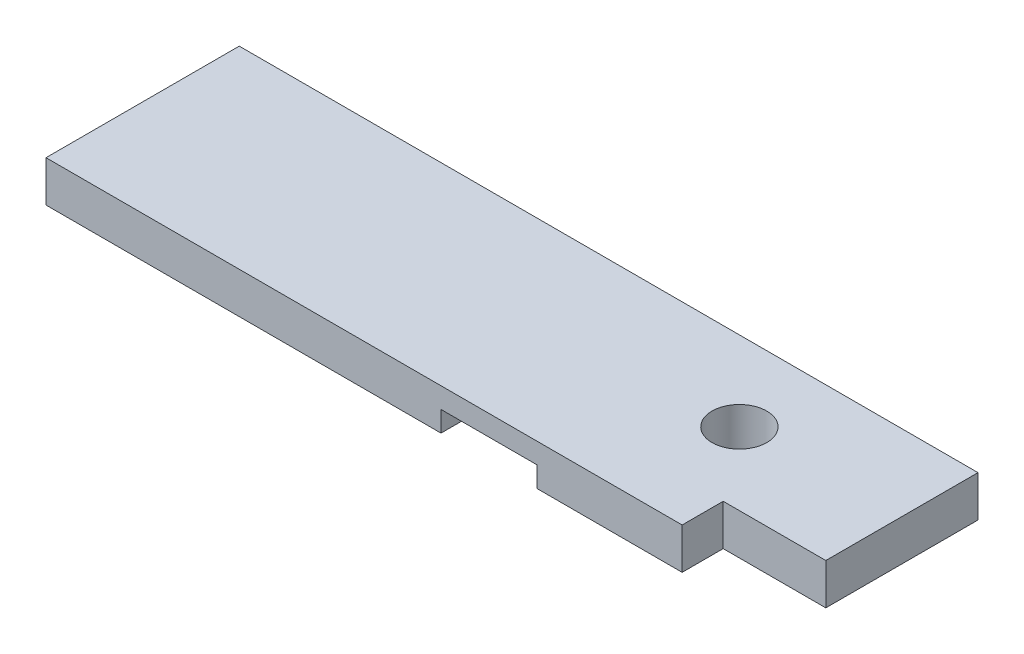
ISO-10303-21;
HEADER;
FILE_DESCRIPTION(('STEP AP214'),'2;1');
FILE_NAME('part.step','',(''),(''),'','','');
FILE_SCHEMA(('AUTOMOTIVE_DESIGN { 1 0 10303 214 1 1 1 1 }'));
ENDSEC;
DATA;
#1=APPLICATION_CONTEXT('core data for automotive mechanical design processes');
#2=APPLICATION_PROTOCOL_DEFINITION('international standard','automotive_design',2000,#1);
#3=PRODUCT_CONTEXT('',#1,'mechanical');
#4=PRODUCT('Part','Part','',(#3));
#5=PRODUCT_RELATED_PRODUCT_CATEGORY('part','',(#4));
#6=PRODUCT_DEFINITION_FORMATION('','',#4);
#7=PRODUCT_DEFINITION_CONTEXT('part definition',#1,'design');
#8=PRODUCT_DEFINITION('design','',#6,#7);
#9=PRODUCT_DEFINITION_SHAPE('','',#8);
#10=(LENGTH_UNIT() NAMED_UNIT(*) SI_UNIT(.MILLI.,.METRE.));
#11=(NAMED_UNIT(*) PLANE_ANGLE_UNIT() SI_UNIT($,.RADIAN.));
#12=(NAMED_UNIT(*) SI_UNIT($,.STERADIAN.) SOLID_ANGLE_UNIT());
#13=UNCERTAINTY_MEASURE_WITH_UNIT(LENGTH_MEASURE(1.E-05),#10,'distance_accuracy_value','');
#14=(GEOMETRIC_REPRESENTATION_CONTEXT(3) GLOBAL_UNCERTAINTY_ASSIGNED_CONTEXT((#13)) GLOBAL_UNIT_ASSIGNED_CONTEXT((#10,
#11,#12)) REPRESENTATION_CONTEXT('',''));
#15=CARTESIAN_POINT('',(0.,0.,0.));
#16=DIRECTION('',(0.,0.,1.));
#17=DIRECTION('',(1.,0.,0.));
#18=AXIS2_PLACEMENT_3D('',#15,#16,#17);
#19=CARTESIAN_POINT('',(0.,0.,0.));
#20=DIRECTION('',(0.,-1.,0.));
#21=DIRECTION('',(0.,0.,-1.));
#22=AXIS2_PLACEMENT_3D('',#19,#20,#21);
#23=PLANE('',#22);
#24=DIRECTION('',(0.,0.,-1.));
#25=VECTOR('',#24,1.);
#26=CARTESIAN_POINT('',(366.70104079,0.,179.400200000003));
#27=LINE('',#26,#25);
#28=CARTESIAN_POINT('',(366.70104079,0.,179.400200000003));
#29=VERTEX_POINT('',#28);
#30=CARTESIAN_POINT('',(366.70104079,0.,0.));
#31=VERTEX_POINT('',#30);
#32=EDGE_CURVE('E234',#29,#31,#27,.T.);
#33=ORIENTED_EDGE('',*,*,#32,.F.);
#34=DIRECTION('',(1.,0.,0.));
#35=VECTOR('',#34,1.);
#36=CARTESIAN_POINT('',(590.5627,0.,179.400200000003));
#37=LINE('',#36,#35);
#38=CARTESIAN_POINT('',(0.,0.,179.400200000003));
#39=VERTEX_POINT('',#38);
#40=EDGE_CURVE('E154',#39,#29,#37,.T.);
#41=ORIENTED_EDGE('',*,*,#40,.F.);
#42=DIRECTION('',(0.,0.,1.));
#43=VECTOR('',#42,1.);
#44=CARTESIAN_POINT('',(0.,0.,0.));
#45=LINE('',#44,#43);
#46=CARTESIAN_POINT('',(0.,0.,0.));
#47=VERTEX_POINT('',#46);
#48=EDGE_CURVE('E148',#47,#39,#45,.T.);
#49=ORIENTED_EDGE('',*,*,#48,.F.);
#50=DIRECTION('',(-1.,0.,0.));
#51=VECTOR('',#50,1.);
#52=CARTESIAN_POINT('',(685.812700000001,0.,0.));
#53=LINE('',#52,#51);
#54=EDGE_CURVE('E95',#31,#47,#53,.T.);
#55=ORIENTED_EDGE('',*,*,#54,.F.);
#56=EDGE_LOOP('',(#33,#41,#49,#55));
#57=FACE_BOUND('',#56,.T.);
#58=ADVANCED_FACE('F43',(#57),#23,.T.);
#59=CARTESIAN_POINT('',(0.,38.1,0.));
#60=DIRECTION('',(0.,-1.,0.));
#61=DIRECTION('',(0.,0.,-1.));
#62=AXIS2_PLACEMENT_3D('',#59,#60,#61);
#63=PLANE('',#62);
#64=DIRECTION('',(0.,0.,1.));
#65=VECTOR('',#64,1.);
#66=CARTESIAN_POINT('',(0.,38.1,0.));
#67=LINE('',#66,#65);
#68=CARTESIAN_POINT('',(0.,38.1,0.));
#69=VERTEX_POINT('',#68);
#70=CARTESIAN_POINT('',(0.,38.1,179.400200000003));
#71=VERTEX_POINT('',#70);
#72=EDGE_CURVE('E170',#69,#71,#67,.T.);
#73=ORIENTED_EDGE('',*,*,#72,.T.);
#74=DIRECTION('',(1.,0.,0.));
#75=VECTOR('',#74,1.);
#76=CARTESIAN_POINT('',(590.5627,38.1,179.400200000003));
#77=LINE('',#76,#75);
#78=CARTESIAN_POINT('',(590.5627,38.1,179.400200000003));
#79=VERTEX_POINT('',#78);
#80=EDGE_CURVE('E103',#71,#79,#77,.T.);
#81=ORIENTED_EDGE('',*,*,#80,.T.);
#82=DIRECTION('',(0.,0.,-1.));
#83=VECTOR('',#82,1.);
#84=CARTESIAN_POINT('',(590.5627,38.1,141.2875));
#85=LINE('',#84,#83);
#86=CARTESIAN_POINT('',(590.5627,38.1,141.2875));
#87=VERTEX_POINT('',#86);
#88=EDGE_CURVE('E121',#79,#87,#85,.T.);
#89=ORIENTED_EDGE('',*,*,#88,.T.);
#90=DIRECTION('',(1.,0.,0.));
#91=VECTOR('',#90,1.);
#92=CARTESIAN_POINT('',(685.812700000001,38.1,141.2875));
#93=LINE('',#92,#91);
#94=CARTESIAN_POINT('',(685.812700000001,38.1,141.2875));
#95=VERTEX_POINT('',#94);
#96=EDGE_CURVE('E113',#87,#95,#93,.T.);
#97=ORIENTED_EDGE('',*,*,#96,.T.);
#98=DIRECTION('',(0.,0.,-1.));
#99=VECTOR('',#98,1.);
#100=CARTESIAN_POINT('',(685.812700000001,38.1,0.));
#101=LINE('',#100,#99);
#102=CARTESIAN_POINT('',(685.812700000001,38.1,0.));
#103=VERTEX_POINT('',#102);
#104=EDGE_CURVE('E118',#95,#103,#101,.T.);
#105=ORIENTED_EDGE('',*,*,#104,.T.);
#106=DIRECTION('',(-1.,0.,0.));
#107=VECTOR('',#106,1.);
#108=CARTESIAN_POINT('',(685.812700000001,38.1,0.));
#109=LINE('',#108,#107);
#110=EDGE_CURVE('E68',#103,#69,#109,.T.);
#111=ORIENTED_EDGE('',*,*,#110,.T.);
#112=EDGE_LOOP('',(#73,#81,#89,#97,#105,#111));
#113=FACE_BOUND('',#112,.T.);
#114=CARTESIAN_POINT('',(538.226,38.1,73.9181909999946));
#115=DIRECTION('',(0.,1.,0.));
#116=DIRECTION('',(0.,0.,1.));
#117=AXIS2_PLACEMENT_3D('',#114,#115,#116);
#118=CIRCLE('',#117,25.4);
#119=CARTESIAN_POINT('',(538.226,38.1,99.3181909999946));
#120=VERTEX_POINT('',#119);
#121=EDGE_CURVE('E153',#120,#120,#118,.T.);
#122=ORIENTED_EDGE('',*,*,#121,.F.);
#123=EDGE_LOOP('',(#122));
#124=FACE_BOUND('',#123,.T.);
#125=ADVANCED_FACE('F115',(#113,#124),#63,.F.);
#126=DIRECTION('',(0.,0.,1.));
#127=VECTOR('',#126,1.);
#128=CARTESIAN_POINT('',(455.60104079,0.,179.400200000003));
#129=LINE('',#128,#127);
#130=CARTESIAN_POINT('',(455.60104079,0.,0.));
#131=VERTEX_POINT('',#130);
#132=CARTESIAN_POINT('',(455.60104079,0.,179.400200000003));
#133=VERTEX_POINT('',#132);
#134=EDGE_CURVE('E230',#131,#133,#129,.T.);
#135=ORIENTED_EDGE('',*,*,#134,.F.);
#136=CARTESIAN_POINT('',(685.812700000001,0.,0.));
#137=VERTEX_POINT('',#136);
#138=EDGE_CURVE('E166',#137,#131,#53,.T.);
#139=ORIENTED_EDGE('',*,*,#138,.F.);
#140=DIRECTION('',(0.,0.,-1.));
#141=VECTOR('',#140,1.);
#142=CARTESIAN_POINT('',(685.812700000001,0.,0.));
#143=LINE('',#142,#141);
#144=CARTESIAN_POINT('',(685.812700000001,0.,141.2875));
#145=VERTEX_POINT('',#144);
#146=EDGE_CURVE('E163',#145,#137,#143,.T.);
#147=ORIENTED_EDGE('',*,*,#146,.F.);
#148=DIRECTION('',(1.,0.,0.));
#149=VECTOR('',#148,1.);
#150=CARTESIAN_POINT('',(685.812700000001,0.,141.2875));
#151=LINE('',#150,#149);
#152=CARTESIAN_POINT('',(590.5627,0.,141.2875));
#153=VERTEX_POINT('',#152);
#154=EDGE_CURVE('E131',#153,#145,#151,.T.);
#155=ORIENTED_EDGE('',*,*,#154,.F.);
#156=DIRECTION('',(0.,0.,-1.));
#157=VECTOR('',#156,1.);
#158=CARTESIAN_POINT('',(590.5627,0.,141.2875));
#159=LINE('',#158,#157);
#160=CARTESIAN_POINT('',(590.5627,0.,179.400200000003));
#161=VERTEX_POINT('',#160);
#162=EDGE_CURVE('E158',#161,#153,#159,.T.);
#163=ORIENTED_EDGE('',*,*,#162,.F.);
#164=EDGE_CURVE('E152',#133,#161,#37,.T.);
#165=ORIENTED_EDGE('',*,*,#164,.F.);
#166=EDGE_LOOP('',(#135,#139,#147,#155,#163,#165));
#167=FACE_BOUND('',#166,.T.);
#168=CARTESIAN_POINT('',(538.226,0.,73.9181909999946));
#169=DIRECTION('',(0.,1.,0.));
#170=DIRECTION('',(0.,0.,1.));
#171=AXIS2_PLACEMENT_3D('',#168,#169,#170);
#172=CIRCLE('',#171,25.4);
#173=CARTESIAN_POINT('',(538.226,0.,99.3181909999946));
#174=VERTEX_POINT('',#173);
#175=EDGE_CURVE('E203',#174,#174,#172,.T.);
#176=ORIENTED_EDGE('',*,*,#175,.T.);
#177=EDGE_LOOP('',(#176));
#178=FACE_BOUND('',#177,.T.);
#179=ADVANCED_FACE('F185',(#167,#178),#23,.T.);
#180=CARTESIAN_POINT('',(0.,38.1,0.));
#181=DIRECTION('',(1.,0.,0.));
#182=DIRECTION('',(0.,0.,-1.));
#183=AXIS2_PLACEMENT_3D('',#180,#181,#182);
#184=PLANE('',#183);
#185=ORIENTED_EDGE('',*,*,#48,.T.);
#186=DIRECTION('',(0.,-1.,0.));
#187=VECTOR('',#186,1.);
#188=CARTESIAN_POINT('',(0.,38.1,179.400200000003));
#189=LINE('',#188,#187);
#190=EDGE_CURVE('E11',#71,#39,#189,.T.);
#191=ORIENTED_EDGE('',*,*,#190,.F.);
#192=ORIENTED_EDGE('',*,*,#72,.F.);
#193=DIRECTION('',(0.,-1.,0.));
#194=VECTOR('',#193,1.);
#195=CARTESIAN_POINT('',(0.,38.1,0.));
#196=LINE('',#195,#194);
#197=EDGE_CURVE('E144',#69,#47,#196,.T.);
#198=ORIENTED_EDGE('',*,*,#197,.T.);
#199=EDGE_LOOP('',(#185,#191,#192,#198));
#200=FACE_BOUND('',#199,.T.);
#201=ADVANCED_FACE('F45',(#200),#184,.F.);
#202=CARTESIAN_POINT('',(590.5627,38.1,179.400200000003));
#203=DIRECTION('',(0.,0.,-1.));
#204=DIRECTION('',(-1.,0.,0.));
#205=AXIS2_PLACEMENT_3D('',#202,#203,#204);
#206=PLANE('',#205);
#207=ORIENTED_EDGE('',*,*,#40,.T.);
#208=DIRECTION('',(0.,-1.,0.));
#209=VECTOR('',#208,1.);
#210=CARTESIAN_POINT('',(366.70104079,19.05,179.400200000003));
#211=LINE('',#210,#209);
#212=CARTESIAN_POINT('',(366.70104079,19.05,179.400200000003));
#213=VERTEX_POINT('',#212);
#214=EDGE_CURVE('E211',#213,#29,#211,.T.);
#215=ORIENTED_EDGE('',*,*,#214,.F.);
#216=DIRECTION('',(-1.,0.,0.));
#217=VECTOR('',#216,1.);
#218=CARTESIAN_POINT('',(366.70104079,19.05,179.400200000003));
#219=LINE('',#218,#217);
#220=CARTESIAN_POINT('',(455.60104079,19.05,179.400200000003));
#221=VERTEX_POINT('',#220);
#222=EDGE_CURVE('E219',#221,#213,#219,.T.);
#223=ORIENTED_EDGE('',*,*,#222,.F.);
#224=DIRECTION('',(0.,-1.,0.));
#225=VECTOR('',#224,1.);
#226=CARTESIAN_POINT('',(455.60104079,19.05,179.400200000003));
#227=LINE('',#226,#225);
#228=EDGE_CURVE('E223',#221,#133,#227,.T.);
#229=ORIENTED_EDGE('',*,*,#228,.T.);
#230=ORIENTED_EDGE('',*,*,#164,.T.);
#231=DIRECTION('',(0.,-1.,0.));
#232=VECTOR('',#231,1.);
#233=CARTESIAN_POINT('',(590.5627,38.1,179.400200000003));
#234=LINE('',#233,#232);
#235=EDGE_CURVE('E52',#79,#161,#234,.T.);
#236=ORIENTED_EDGE('',*,*,#235,.F.);
#237=ORIENTED_EDGE('',*,*,#80,.F.);
#238=ORIENTED_EDGE('',*,*,#190,.T.);
#239=EDGE_LOOP('',(#207,#215,#223,#229,#230,#236,#237,#238));
#240=FACE_BOUND('',#239,.T.);
#241=ADVANCED_FACE('F270',(#240),#206,.F.);
#242=CARTESIAN_POINT('',(590.5627,38.1,141.2875));
#243=DIRECTION('',(-1.,0.,0.));
#244=DIRECTION('',(0.,0.,1.));
#245=AXIS2_PLACEMENT_3D('',#242,#243,#244);
#246=PLANE('',#245);
#247=ORIENTED_EDGE('',*,*,#162,.T.);
#248=DIRECTION('',(0.,-1.,0.));
#249=VECTOR('',#248,1.);
#250=CARTESIAN_POINT('',(590.5627,38.1,141.2875));
#251=LINE('',#250,#249);
#252=EDGE_CURVE('E135',#87,#153,#251,.T.);
#253=ORIENTED_EDGE('',*,*,#252,.F.);
#254=ORIENTED_EDGE('',*,*,#88,.F.);
#255=ORIENTED_EDGE('',*,*,#235,.T.);
#256=EDGE_LOOP('',(#247,#253,#254,#255));
#257=FACE_BOUND('',#256,.T.);
#258=ADVANCED_FACE('F181',(#257),#246,.F.);
#259=CARTESIAN_POINT('',(685.812700000001,38.1,141.2875));
#260=DIRECTION('',(0.,0.,-1.));
#261=DIRECTION('',(-1.,0.,0.));
#262=AXIS2_PLACEMENT_3D('',#259,#260,#261);
#263=PLANE('',#262);
#264=ORIENTED_EDGE('',*,*,#154,.T.);
#265=DIRECTION('',(0.,-1.,0.));
#266=VECTOR('',#265,1.);
#267=CARTESIAN_POINT('',(685.812700000001,38.1,141.2875));
#268=LINE('',#267,#266);
#269=EDGE_CURVE('E128',#95,#145,#268,.T.);
#270=ORIENTED_EDGE('',*,*,#269,.F.);
#271=ORIENTED_EDGE('',*,*,#96,.F.);
#272=ORIENTED_EDGE('',*,*,#252,.T.);
#273=EDGE_LOOP('',(#264,#270,#271,#272));
#274=FACE_BOUND('',#273,.T.);
#275=ADVANCED_FACE('F129',(#274),#263,.F.);
#276=CARTESIAN_POINT('',(685.812700000001,38.1,0.));
#277=DIRECTION('',(-1.,0.,0.));
#278=DIRECTION('',(0.,0.,1.));
#279=AXIS2_PLACEMENT_3D('',#276,#277,#278);
#280=PLANE('',#279);
#281=ORIENTED_EDGE('',*,*,#146,.T.);
#282=DIRECTION('',(0.,-1.,0.));
#283=VECTOR('',#282,1.);
#284=CARTESIAN_POINT('',(685.812700000001,38.1,0.));
#285=LINE('',#284,#283);
#286=EDGE_CURVE('E136',#103,#137,#285,.T.);
#287=ORIENTED_EDGE('',*,*,#286,.F.);
#288=ORIENTED_EDGE('',*,*,#104,.F.);
#289=ORIENTED_EDGE('',*,*,#269,.T.);
#290=EDGE_LOOP('',(#281,#287,#288,#289));
#291=FACE_BOUND('',#290,.T.);
#292=ADVANCED_FACE('F138',(#291),#280,.F.);
#293=CARTESIAN_POINT('',(685.812700000001,38.1,0.));
#294=DIRECTION('',(0.,0.,1.));
#295=DIRECTION('',(1.,0.,0.));
#296=AXIS2_PLACEMENT_3D('',#293,#294,#295);
#297=PLANE('',#296);
#298=DIRECTION('',(1.,0.,0.));
#299=VECTOR('',#298,1.);
#300=CARTESIAN_POINT('',(366.70104079,19.05,0.));
#301=LINE('',#300,#299);
#302=CARTESIAN_POINT('',(366.70104079,19.05,0.));
#303=VERTEX_POINT('',#302);
#304=CARTESIAN_POINT('',(455.60104079,19.05,0.));
#305=VERTEX_POINT('',#304);
#306=EDGE_CURVE('E244',#303,#305,#301,.T.);
#307=ORIENTED_EDGE('',*,*,#306,.F.);
#308=DIRECTION('',(0.,-1.,0.));
#309=VECTOR('',#308,1.);
#310=CARTESIAN_POINT('',(366.70104079,19.05,0.));
#311=LINE('',#310,#309);
#312=EDGE_CURVE('E215',#303,#31,#311,.T.);
#313=ORIENTED_EDGE('',*,*,#312,.T.);
#314=ORIENTED_EDGE('',*,*,#54,.T.);
#315=ORIENTED_EDGE('',*,*,#197,.F.);
#316=ORIENTED_EDGE('',*,*,#110,.F.);
#317=ORIENTED_EDGE('',*,*,#286,.T.);
#318=ORIENTED_EDGE('',*,*,#138,.T.);
#319=DIRECTION('',(0.,-1.,0.));
#320=VECTOR('',#319,1.);
#321=CARTESIAN_POINT('',(455.60104079,19.05,0.));
#322=LINE('',#321,#320);
#323=EDGE_CURVE('E218',#305,#131,#322,.T.);
#324=ORIENTED_EDGE('',*,*,#323,.F.);
#325=EDGE_LOOP('',(#307,#313,#314,#315,#316,#317,#318,#324));
#326=FACE_BOUND('',#325,.T.);
#327=ADVANCED_FACE('F190',(#326),#297,.F.);
#328=CARTESIAN_POINT('',(538.226,38.1,73.9181909999946));
#329=DIRECTION('',(0.,-1.,0.));
#330=DIRECTION('',(0.,0.,-1.));
#331=AXIS2_PLACEMENT_3D('',#328,#329,#330);
#332=CYLINDRICAL_SURFACE('',#331,25.4);
#333=ORIENTED_EDGE('',*,*,#121,.T.);
#334=EDGE_LOOP('',(#333));
#335=FACE_BOUND('',#334,.T.);
#336=ORIENTED_EDGE('',*,*,#175,.F.);
#337=EDGE_LOOP('',(#336));
#338=FACE_BOUND('',#337,.T.);
#339=ADVANCED_FACE('F314',(#335,#338),#332,.F.);
#340=CARTESIAN_POINT('',(366.70104079,19.05,179.400200000003));
#341=DIRECTION('',(-1.,0.,0.));
#342=DIRECTION('',(0.,0.,1.));
#343=AXIS2_PLACEMENT_3D('',#340,#341,#342);
#344=PLANE('',#343);
#345=ORIENTED_EDGE('',*,*,#32,.T.);
#346=ORIENTED_EDGE('',*,*,#312,.F.);
#347=DIRECTION('',(0.,0.,-1.));
#348=VECTOR('',#347,1.);
#349=CARTESIAN_POINT('',(366.70104079,19.05,179.400200000003));
#350=LINE('',#349,#348);
#351=EDGE_CURVE('E59',#213,#303,#350,.T.);
#352=ORIENTED_EDGE('',*,*,#351,.F.);
#353=ORIENTED_EDGE('',*,*,#214,.T.);
#354=EDGE_LOOP('',(#345,#346,#352,#353));
#355=FACE_BOUND('',#354,.T.);
#356=ADVANCED_FACE('F287',(#355),#344,.F.);
#357=CARTESIAN_POINT('',(455.60104079,19.05,179.400200000003));
#358=DIRECTION('',(1.,0.,0.));
#359=DIRECTION('',(0.,0.,-1.));
#360=AXIS2_PLACEMENT_3D('',#357,#358,#359);
#361=PLANE('',#360);
#362=ORIENTED_EDGE('',*,*,#134,.T.);
#363=ORIENTED_EDGE('',*,*,#228,.F.);
#364=DIRECTION('',(0.,0.,1.));
#365=VECTOR('',#364,1.);
#366=CARTESIAN_POINT('',(455.60104079,19.05,179.400200000003));
#367=LINE('',#366,#365);
#368=EDGE_CURVE('E240',#305,#221,#367,.T.);
#369=ORIENTED_EDGE('',*,*,#368,.F.);
#370=ORIENTED_EDGE('',*,*,#323,.T.);
#371=EDGE_LOOP('',(#362,#363,#369,#370));
#372=FACE_BOUND('',#371,.T.);
#373=ADVANCED_FACE('F277',(#372),#361,.F.);
#374=CARTESIAN_POINT('',(0.,19.05,0.));
#375=DIRECTION('',(0.,-1.,0.));
#376=DIRECTION('',(0.,0.,-1.));
#377=AXIS2_PLACEMENT_3D('',#374,#375,#376);
#378=PLANE('',#377);
#379=ORIENTED_EDGE('',*,*,#351,.T.);
#380=ORIENTED_EDGE('',*,*,#306,.T.);
#381=ORIENTED_EDGE('',*,*,#368,.T.);
#382=ORIENTED_EDGE('',*,*,#222,.T.);
#383=EDGE_LOOP('',(#379,#380,#381,#382));
#384=FACE_BOUND('',#383,.T.);
#385=ADVANCED_FACE('F280',(#384),#378,.T.);
#386=CLOSED_SHELL('',(#58,#125,#179,#201,#241,#258,#275,#292,#327,#339,#356,#373,#385));
#387=MANIFOLD_SOLID_BREP('B2',#386);
#388=ADVANCED_BREP_SHAPE_REPRESENTATION('',(#18,#387),#14);
#389=SHAPE_DEFINITION_REPRESENTATION(#9,#388);
ENDSEC;
END-ISO-10303-21;
